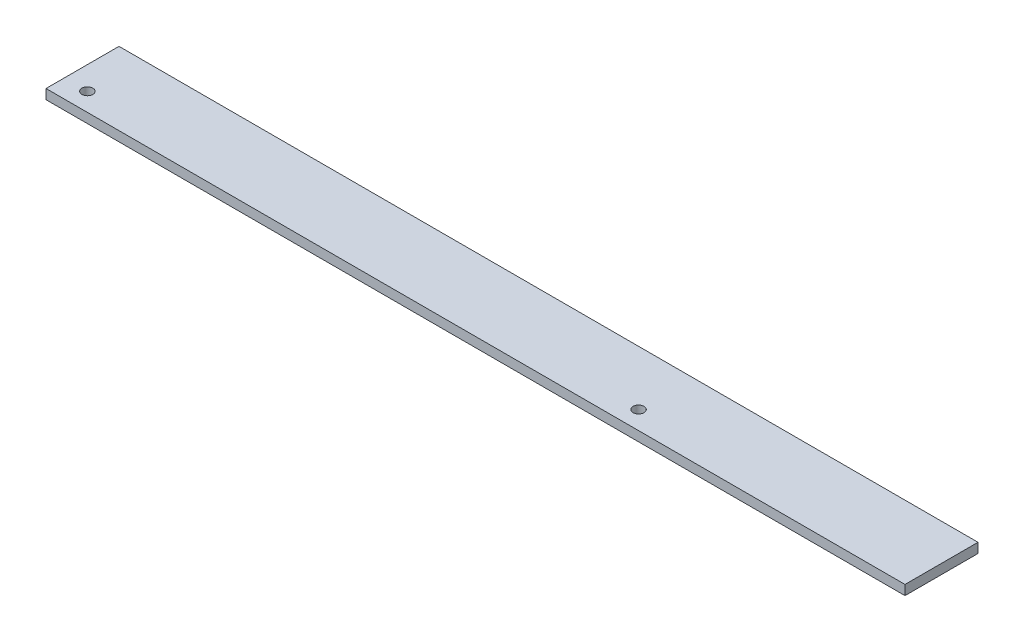
ISO-10303-21;
HEADER;
FILE_DESCRIPTION(('STEP AP214'),'2;1');
FILE_NAME('part.step','',(''),(''),'','','');
FILE_SCHEMA(('AUTOMOTIVE_DESIGN { 1 0 10303 214 1 1 1 1 }'));
ENDSEC;
DATA;
#1=APPLICATION_CONTEXT('core data for automotive mechanical design processes');
#2=APPLICATION_PROTOCOL_DEFINITION('international standard','automotive_design',2000,#1);
#3=PRODUCT_CONTEXT('',#1,'mechanical');
#4=PRODUCT('Part','Part','',(#3));
#5=PRODUCT_RELATED_PRODUCT_CATEGORY('part','',(#4));
#6=PRODUCT_DEFINITION_FORMATION('','',#4);
#7=PRODUCT_DEFINITION_CONTEXT('part definition',#1,'design');
#8=PRODUCT_DEFINITION('design','',#6,#7);
#9=PRODUCT_DEFINITION_SHAPE('','',#8);
#10=(LENGTH_UNIT() NAMED_UNIT(*) SI_UNIT(.MILLI.,.METRE.));
#11=(NAMED_UNIT(*) PLANE_ANGLE_UNIT() SI_UNIT($,.RADIAN.));
#12=(NAMED_UNIT(*) SI_UNIT($,.STERADIAN.) SOLID_ANGLE_UNIT());
#13=UNCERTAINTY_MEASURE_WITH_UNIT(LENGTH_MEASURE(1.E-05),#10,'distance_accuracy_value','');
#14=(GEOMETRIC_REPRESENTATION_CONTEXT(3) GLOBAL_UNCERTAINTY_ASSIGNED_CONTEXT((#13)) GLOBAL_UNIT_ASSIGNED_CONTEXT((#10,
#11,#12)) REPRESENTATION_CONTEXT('',''));
#15=CARTESIAN_POINT('',(0.,0.,0.));
#16=DIRECTION('',(0.,0.,1.));
#17=DIRECTION('',(1.,0.,0.));
#18=AXIS2_PLACEMENT_3D('',#15,#16,#17);
#19=CARTESIAN_POINT('',(353.,-2.,-15.));
#20=DIRECTION('',(0.,0.,1.));
#21=DIRECTION('',(1.,0.,0.));
#22=AXIS2_PLACEMENT_3D('',#19,#20,#21);
#23=PLANE('',#22);
#24=DIRECTION('',(0.,1.,0.));
#25=VECTOR('',#24,1.);
#26=CARTESIAN_POINT('',(0.,-2.,-15.));
#27=LINE('',#26,#25);
#28=CARTESIAN_POINT('',(0.,-2.,-15.));
#29=VERTEX_POINT('',#28);
#30=CARTESIAN_POINT('',(0.,2.,-15.));
#31=VERTEX_POINT('',#30);
#32=EDGE_CURVE('E99',#29,#31,#27,.T.);
#33=ORIENTED_EDGE('',*,*,#32,.T.);
#34=DIRECTION('',(-1.,0.,0.));
#35=VECTOR('',#34,1.);
#36=CARTESIAN_POINT('',(353.,2.,-15.));
#37=LINE('',#36,#35);
#38=CARTESIAN_POINT('',(353.,2.,-15.));
#39=VERTEX_POINT('',#38);
#40=EDGE_CURVE('E11',#39,#31,#37,.T.);
#41=ORIENTED_EDGE('',*,*,#40,.F.);
#42=DIRECTION('',(0.,1.,0.));
#43=VECTOR('',#42,1.);
#44=CARTESIAN_POINT('',(353.,-2.,-15.));
#45=LINE('',#44,#43);
#46=CARTESIAN_POINT('',(353.,-2.,-15.));
#47=VERTEX_POINT('',#46);
#48=EDGE_CURVE('E87',#47,#39,#45,.T.);
#49=ORIENTED_EDGE('',*,*,#48,.F.);
#50=DIRECTION('',(-1.,0.,0.));
#51=VECTOR('',#50,1.);
#52=CARTESIAN_POINT('',(353.,-2.,-15.));
#53=LINE('',#52,#51);
#54=EDGE_CURVE('E95',#47,#29,#53,.T.);
#55=ORIENTED_EDGE('',*,*,#54,.T.);
#56=EDGE_LOOP('',(#33,#41,#49,#55));
#57=FACE_BOUND('',#56,.T.);
#58=ADVANCED_FACE('F36',(#57),#23,.F.);
#59=CARTESIAN_POINT('',(353.,2.,15.));
#60=DIRECTION('',(0.,-1.,0.));
#61=DIRECTION('',(0.,0.,-1.));
#62=AXIS2_PLACEMENT_3D('',#59,#60,#61);
#63=PLANE('',#62);
#64=CARTESIAN_POINT('',(9.5,2.,7.5));
#65=DIRECTION('',(0.,1.,0.));
#66=DIRECTION('',(0.,0.,1.));
#67=AXIS2_PLACEMENT_3D('',#64,#65,#66);
#68=CIRCLE('',#67,2.25);
#69=CARTESIAN_POINT('',(9.5,2.,9.75));
#70=VERTEX_POINT('',#69);
#71=EDGE_CURVE('E119',#70,#70,#68,.T.);
#72=ORIENTED_EDGE('',*,*,#71,.F.);
#73=EDGE_LOOP('',(#72));
#74=FACE_BOUND('',#73,.T.);
#75=CARTESIAN_POINT('',(236.,2.,7.5));
#76=DIRECTION('',(0.,1.,0.));
#77=DIRECTION('',(0.,0.,1.));
#78=AXIS2_PLACEMENT_3D('',#75,#76,#77);
#79=CIRCLE('',#78,2.24999999999995);
#80=CARTESIAN_POINT('',(236.,2.,9.74999999999995));
#81=VERTEX_POINT('',#80);
#82=EDGE_CURVE('E113',#81,#81,#79,.T.);
#83=ORIENTED_EDGE('',*,*,#82,.F.);
#84=EDGE_LOOP('',(#83));
#85=FACE_BOUND('',#84,.T.);
#86=DIRECTION('',(0.,0.,1.));
#87=VECTOR('',#86,1.);
#88=CARTESIAN_POINT('',(0.,2.,15.));
#89=LINE('',#88,#87);
#90=CARTESIAN_POINT('',(0.,2.,15.));
#91=VERTEX_POINT('',#90);
#92=EDGE_CURVE('E91',#31,#91,#89,.T.);
#93=ORIENTED_EDGE('',*,*,#92,.T.);
#94=DIRECTION('',(-1.,0.,0.));
#95=VECTOR('',#94,1.);
#96=CARTESIAN_POINT('',(353.,2.,15.));
#97=LINE('',#96,#95);
#98=CARTESIAN_POINT('',(353.,2.,15.));
#99=VERTEX_POINT('',#98);
#100=EDGE_CURVE('E44',#99,#91,#97,.T.);
#101=ORIENTED_EDGE('',*,*,#100,.F.);
#102=DIRECTION('',(0.,0.,1.));
#103=VECTOR('',#102,1.);
#104=CARTESIAN_POINT('',(353.,2.,15.));
#105=LINE('',#104,#103);
#106=EDGE_CURVE('E82',#39,#99,#105,.T.);
#107=ORIENTED_EDGE('',*,*,#106,.F.);
#108=ORIENTED_EDGE('',*,*,#40,.T.);
#109=EDGE_LOOP('',(#93,#101,#107,#108));
#110=FACE_BOUND('',#109,.T.);
#111=ADVANCED_FACE('F90',(#74,#85,#110),#63,.F.);
#112=CARTESIAN_POINT('',(353.,-2.,15.));
#113=DIRECTION('',(0.,0.,-1.));
#114=DIRECTION('',(-1.,0.,0.));
#115=AXIS2_PLACEMENT_3D('',#112,#113,#114);
#116=PLANE('',#115);
#117=DIRECTION('',(0.,-1.,0.));
#118=VECTOR('',#117,1.);
#119=CARTESIAN_POINT('',(0.,-2.,15.));
#120=LINE('',#119,#118);
#121=CARTESIAN_POINT('',(0.,-2.,15.));
#122=VERTEX_POINT('',#121);
#123=EDGE_CURVE('E69',#91,#122,#120,.T.);
#124=ORIENTED_EDGE('',*,*,#123,.T.);
#125=DIRECTION('',(-1.,0.,0.));
#126=VECTOR('',#125,1.);
#127=CARTESIAN_POINT('',(353.,-2.,15.));
#128=LINE('',#127,#126);
#129=CARTESIAN_POINT('',(353.,-2.,15.));
#130=VERTEX_POINT('',#129);
#131=EDGE_CURVE('E92',#130,#122,#128,.T.);
#132=ORIENTED_EDGE('',*,*,#131,.F.);
#133=DIRECTION('',(0.,-1.,0.));
#134=VECTOR('',#133,1.);
#135=CARTESIAN_POINT('',(353.,-2.,15.));
#136=LINE('',#135,#134);
#137=EDGE_CURVE('E85',#99,#130,#136,.T.);
#138=ORIENTED_EDGE('',*,*,#137,.F.);
#139=ORIENTED_EDGE('',*,*,#100,.T.);
#140=EDGE_LOOP('',(#124,#132,#138,#139));
#141=FACE_BOUND('',#140,.T.);
#142=ADVANCED_FACE('F93',(#141),#116,.F.);
#143=CARTESIAN_POINT('',(353.,-2.,15.));
#144=DIRECTION('',(0.,1.,0.));
#145=DIRECTION('',(0.,0.,1.));
#146=AXIS2_PLACEMENT_3D('',#143,#144,#145);
#147=PLANE('',#146);
#148=CARTESIAN_POINT('',(9.5,-2.,7.5));
#149=DIRECTION('',(0.,1.,0.));
#150=DIRECTION('',(0.,0.,1.));
#151=AXIS2_PLACEMENT_3D('',#148,#149,#150);
#152=CIRCLE('',#151,2.25);
#153=CARTESIAN_POINT('',(9.5,-2.,9.75));
#154=VERTEX_POINT('',#153);
#155=EDGE_CURVE('E102',#154,#154,#152,.T.);
#156=ORIENTED_EDGE('',*,*,#155,.T.);
#157=EDGE_LOOP('',(#156));
#158=FACE_BOUND('',#157,.T.);
#159=CARTESIAN_POINT('',(236.,-2.,7.5));
#160=DIRECTION('',(0.,1.,0.));
#161=DIRECTION('',(0.,0.,1.));
#162=AXIS2_PLACEMENT_3D('',#159,#160,#161);
#163=CIRCLE('',#162,2.24999999999995);
#164=CARTESIAN_POINT('',(236.,-2.,9.74999999999995));
#165=VERTEX_POINT('',#164);
#166=EDGE_CURVE('E116',#165,#165,#163,.T.);
#167=ORIENTED_EDGE('',*,*,#166,.T.);
#168=EDGE_LOOP('',(#167));
#169=FACE_BOUND('',#168,.T.);
#170=DIRECTION('',(0.,0.,-1.));
#171=VECTOR('',#170,1.);
#172=CARTESIAN_POINT('',(0.,-2.,15.));
#173=LINE('',#172,#171);
#174=EDGE_CURVE('E75',#122,#29,#173,.T.);
#175=ORIENTED_EDGE('',*,*,#174,.T.);
#176=ORIENTED_EDGE('',*,*,#54,.F.);
#177=DIRECTION('',(0.,0.,-1.));
#178=VECTOR('',#177,1.);
#179=CARTESIAN_POINT('',(353.,-2.,15.));
#180=LINE('',#179,#178);
#181=EDGE_CURVE('E52',#130,#47,#180,.T.);
#182=ORIENTED_EDGE('',*,*,#181,.F.);
#183=ORIENTED_EDGE('',*,*,#131,.T.);
#184=EDGE_LOOP('',(#175,#176,#182,#183));
#185=FACE_BOUND('',#184,.T.);
#186=ADVANCED_FACE('F107',(#158,#169,#185),#147,.F.);
#187=CARTESIAN_POINT('',(353.,0.,0.));
#188=DIRECTION('',(-1.,0.,0.));
#189=DIRECTION('',(0.,0.,1.));
#190=AXIS2_PLACEMENT_3D('',#187,#188,#189);
#191=PLANE('',#190);
#192=ORIENTED_EDGE('',*,*,#48,.T.);
#193=ORIENTED_EDGE('',*,*,#106,.T.);
#194=ORIENTED_EDGE('',*,*,#137,.T.);
#195=ORIENTED_EDGE('',*,*,#181,.T.);
#196=EDGE_LOOP('',(#192,#193,#194,#195));
#197=FACE_BOUND('',#196,.T.);
#198=ADVANCED_FACE('F83',(#197),#191,.F.);
#199=CARTESIAN_POINT('',(0.,0.,0.));
#200=DIRECTION('',(-1.,0.,0.));
#201=DIRECTION('',(0.,0.,1.));
#202=AXIS2_PLACEMENT_3D('',#199,#200,#201);
#203=PLANE('',#202);
#204=ORIENTED_EDGE('',*,*,#32,.F.);
#205=ORIENTED_EDGE('',*,*,#174,.F.);
#206=ORIENTED_EDGE('',*,*,#123,.F.);
#207=ORIENTED_EDGE('',*,*,#92,.F.);
#208=EDGE_LOOP('',(#204,#205,#206,#207));
#209=FACE_BOUND('',#208,.T.);
#210=ADVANCED_FACE('F110',(#209),#203,.T.);
#211=CARTESIAN_POINT('',(236.,-2.,7.5));
#212=DIRECTION('',(0.,1.,0.));
#213=DIRECTION('',(0.,0.,1.));
#214=AXIS2_PLACEMENT_3D('',#211,#212,#213);
#215=CYLINDRICAL_SURFACE('',#214,2.24999999999995);
#216=ORIENTED_EDGE('',*,*,#166,.F.);
#217=EDGE_LOOP('',(#216));
#218=FACE_BOUND('',#217,.T.);
#219=ORIENTED_EDGE('',*,*,#82,.T.);
#220=EDGE_LOOP('',(#219));
#221=FACE_BOUND('',#220,.T.);
#222=ADVANCED_FACE('F130',(#218,#221),#215,.F.);
#223=CARTESIAN_POINT('',(9.5,-2.,7.5));
#224=DIRECTION('',(0.,1.,0.));
#225=DIRECTION('',(0.,0.,1.));
#226=AXIS2_PLACEMENT_3D('',#223,#224,#225);
#227=CYLINDRICAL_SURFACE('',#226,2.25);
#228=ORIENTED_EDGE('',*,*,#155,.F.);
#229=EDGE_LOOP('',(#228));
#230=FACE_BOUND('',#229,.T.);
#231=ORIENTED_EDGE('',*,*,#71,.T.);
#232=EDGE_LOOP('',(#231));
#233=FACE_BOUND('',#232,.T.);
#234=ADVANCED_FACE('F127',(#230,#233),#227,.F.);
#235=CLOSED_SHELL('',(#58,#111,#142,#186,#198,#210,#222,#234));
#236=MANIFOLD_SOLID_BREP('B2',#235);
#237=ADVANCED_BREP_SHAPE_REPRESENTATION('',(#18,#236),#14);
#238=SHAPE_DEFINITION_REPRESENTATION(#9,#237);
ENDSEC;
END-ISO-10303-21;
